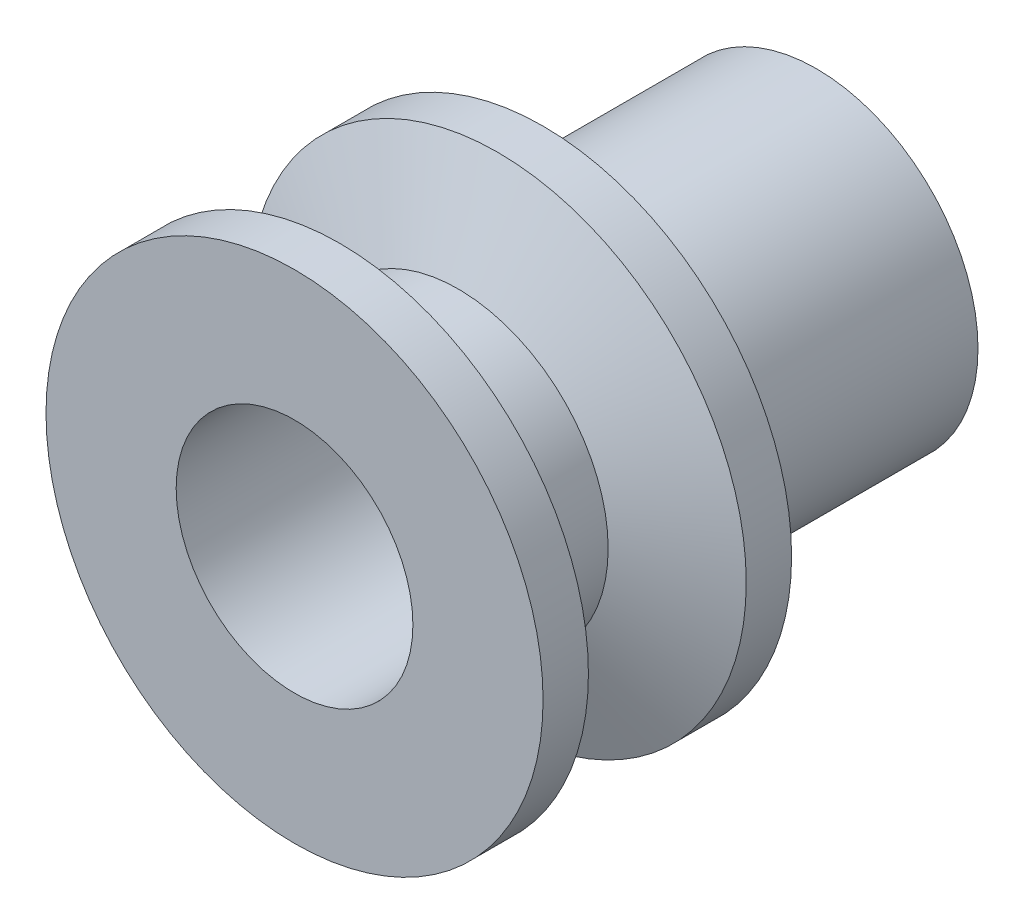
ISO-10303-21;
HEADER;
FILE_DESCRIPTION(('STEP AP214'),'2;1');
FILE_NAME('part.step','',(''),(''),'','','');
FILE_SCHEMA(('AUTOMOTIVE_DESIGN { 1 0 10303 214 1 1 1 1 }'));
ENDSEC;
DATA;
#1=APPLICATION_CONTEXT('core data for automotive mechanical design processes');
#2=APPLICATION_PROTOCOL_DEFINITION('international standard','automotive_design',2000,#1);
#3=PRODUCT_CONTEXT('',#1,'mechanical');
#4=PRODUCT('Part','Part','',(#3));
#5=PRODUCT_RELATED_PRODUCT_CATEGORY('part','',(#4));
#6=PRODUCT_DEFINITION_FORMATION('','',#4);
#7=PRODUCT_DEFINITION_CONTEXT('part definition',#1,'design');
#8=PRODUCT_DEFINITION('design','',#6,#7);
#9=PRODUCT_DEFINITION_SHAPE('','',#8);
#10=(LENGTH_UNIT() NAMED_UNIT(*) SI_UNIT(.MILLI.,.METRE.));
#11=(NAMED_UNIT(*) PLANE_ANGLE_UNIT() SI_UNIT($,.RADIAN.));
#12=(NAMED_UNIT(*) SI_UNIT($,.STERADIAN.) SOLID_ANGLE_UNIT());
#13=UNCERTAINTY_MEASURE_WITH_UNIT(LENGTH_MEASURE(1.E-05),#10,'distance_accuracy_value','');
#14=(GEOMETRIC_REPRESENTATION_CONTEXT(3) GLOBAL_UNCERTAINTY_ASSIGNED_CONTEXT((#13)) GLOBAL_UNIT_ASSIGNED_CONTEXT((#10,
#11,#12)) REPRESENTATION_CONTEXT('',''));
#15=CARTESIAN_POINT('',(0.,0.,0.));
#16=DIRECTION('',(0.,0.,1.));
#17=DIRECTION('',(1.,0.,0.));
#18=AXIS2_PLACEMENT_3D('',#15,#16,#17);
#19=CARTESIAN_POINT('',(9.52500000000001,0.,0.));
#20=DIRECTION('',(0.,0.,1.));
#21=DIRECTION('',(1.,0.,0.));
#22=AXIS2_PLACEMENT_3D('',#19,#20,#21);
#23=PLANE('',#22);
#24=CARTESIAN_POINT('',(0.,0.,0.));
#25=DIRECTION('',(0.,0.,1.));
#26=DIRECTION('',(1.,0.,0.));
#27=AXIS2_PLACEMENT_3D('',#24,#25,#26);
#28=CIRCLE('',#27,20.);
#29=CARTESIAN_POINT('',(20.,0.,0.));
#30=VERTEX_POINT('',#29);
#31=EDGE_CURVE('E10',#30,#30,#28,.T.);
#32=ORIENTED_EDGE('',*,*,#31,.T.);
#33=EDGE_LOOP('',(#32));
#34=FACE_BOUND('',#33,.T.);
#35=CARTESIAN_POINT('',(0.,0.,0.));
#36=DIRECTION('',(0.,0.,1.));
#37=DIRECTION('',(1.,0.,0.));
#38=AXIS2_PLACEMENT_3D('',#35,#36,#37);
#39=CIRCLE('',#38,9.52500000000001);
#40=CARTESIAN_POINT('',(9.52500000000001,0.,0.));
#41=VERTEX_POINT('',#40);
#42=EDGE_CURVE('E85',#41,#41,#39,.T.);
#43=ORIENTED_EDGE('',*,*,#42,.F.);
#44=EDGE_LOOP('',(#43));
#45=FACE_BOUND('',#44,.T.);
#46=ADVANCED_FACE('F37',(#34,#45),#23,.T.);
#47=CARTESIAN_POINT('',(0.,0.,0.));
#48=DIRECTION('',(0.,0.,1.));
#49=DIRECTION('',(1.,0.,0.));
#50=AXIS2_PLACEMENT_3D('',#47,#48,#49);
#51=CYLINDRICAL_SURFACE('',#50,20.);
#52=CARTESIAN_POINT('',(0.,0.,-3.65));
#53=DIRECTION('',(0.,0.,1.));
#54=DIRECTION('',(1.,0.,0.));
#55=AXIS2_PLACEMENT_3D('',#52,#53,#54);
#56=CIRCLE('',#55,20.);
#57=CARTESIAN_POINT('',(20.,0.,-3.65));
#58=VERTEX_POINT('',#57);
#59=EDGE_CURVE('E50',#58,#58,#56,.T.);
#60=ORIENTED_EDGE('',*,*,#59,.T.);
#61=EDGE_LOOP('',(#60));
#62=FACE_BOUND('',#61,.T.);
#63=ORIENTED_EDGE('',*,*,#31,.F.);
#64=EDGE_LOOP('',(#63));
#65=FACE_BOUND('',#64,.T.);
#66=ADVANCED_FACE('F119',(#62,#65),#51,.T.);
#67=CARTESIAN_POINT('',(0.,0.,-3.65));
#68=DIRECTION('',(0.,0.,1.));
#69=DIRECTION('',(1.,0.,0.));
#70=AXIS2_PLACEMENT_3D('',#67,#68,#69);
#71=CONICAL_SURFACE('',#70,20.,1.19028994968253);
#72=CARTESIAN_POINT('',(0.,0.,-6.825));
#73=DIRECTION('',(0.,0.,1.));
#74=DIRECTION('',(1.,0.,0.));
#75=AXIS2_PLACEMENT_3D('',#72,#73,#74);
#76=CIRCLE('',#75,12.0625);
#77=CARTESIAN_POINT('',(12.0625,0.,-6.825));
#78=VERTEX_POINT('',#77);
#79=EDGE_CURVE('E55',#78,#78,#76,.T.);
#80=ORIENTED_EDGE('',*,*,#79,.T.);
#81=EDGE_LOOP('',(#80));
#82=FACE_BOUND('',#81,.T.);
#83=ORIENTED_EDGE('',*,*,#59,.F.);
#84=EDGE_LOOP('',(#83));
#85=FACE_BOUND('',#84,.T.);
#86=ADVANCED_FACE('F123',(#82,#85),#71,.T.);
#87=CARTESIAN_POINT('',(0.,0.,0.));
#88=DIRECTION('',(0.,0.,1.));
#89=DIRECTION('',(1.,0.,0.));
#90=AXIS2_PLACEMENT_3D('',#87,#88,#89);
#91=CYLINDRICAL_SURFACE('',#90,12.0625);
#92=CARTESIAN_POINT('',(0.,0.,-13.175));
#93=DIRECTION('',(0.,0.,1.));
#94=DIRECTION('',(1.,0.,0.));
#95=AXIS2_PLACEMENT_3D('',#92,#93,#94);
#96=CIRCLE('',#95,12.0625);
#97=CARTESIAN_POINT('',(12.0625,0.,-13.175));
#98=VERTEX_POINT('',#97);
#99=EDGE_CURVE('E61',#98,#98,#96,.T.);
#100=ORIENTED_EDGE('',*,*,#99,.T.);
#101=EDGE_LOOP('',(#100));
#102=FACE_BOUND('',#101,.T.);
#103=ORIENTED_EDGE('',*,*,#79,.F.);
#104=EDGE_LOOP('',(#103));
#105=FACE_BOUND('',#104,.T.);
#106=ADVANCED_FACE('F133',(#102,#105),#91,.T.);
#107=CARTESIAN_POINT('',(0.,0.,-13.175));
#108=DIRECTION('',(0.,0.,-1.));
#109=DIRECTION('',(-1.,0.,0.));
#110=AXIS2_PLACEMENT_3D('',#107,#108,#109);
#111=CONICAL_SURFACE('',#110,12.0625,1.19028994968253);
#112=CARTESIAN_POINT('',(0.,0.,-16.35));
#113=DIRECTION('',(0.,0.,1.));
#114=DIRECTION('',(1.,0.,0.));
#115=AXIS2_PLACEMENT_3D('',#112,#113,#114);
#116=CIRCLE('',#115,20.);
#117=CARTESIAN_POINT('',(20.,0.,-16.35));
#118=VERTEX_POINT('',#117);
#119=EDGE_CURVE('E65',#118,#118,#116,.T.);
#120=ORIENTED_EDGE('',*,*,#119,.T.);
#121=EDGE_LOOP('',(#120));
#122=FACE_BOUND('',#121,.T.);
#123=ORIENTED_EDGE('',*,*,#99,.F.);
#124=EDGE_LOOP('',(#123));
#125=FACE_BOUND('',#124,.T.);
#126=ADVANCED_FACE('F140',(#122,#125),#111,.T.);
#127=CARTESIAN_POINT('',(0.,0.,0.));
#128=DIRECTION('',(0.,0.,1.));
#129=DIRECTION('',(1.,0.,0.));
#130=AXIS2_PLACEMENT_3D('',#127,#128,#129);
#131=CYLINDRICAL_SURFACE('',#130,20.);
#132=CARTESIAN_POINT('',(0.,0.,-20.));
#133=DIRECTION('',(0.,0.,1.));
#134=DIRECTION('',(1.,0.,0.));
#135=AXIS2_PLACEMENT_3D('',#132,#133,#134);
#136=CIRCLE('',#135,20.);
#137=CARTESIAN_POINT('',(20.,0.,-20.));
#138=VERTEX_POINT('',#137);
#139=EDGE_CURVE('E69',#138,#138,#136,.T.);
#140=ORIENTED_EDGE('',*,*,#139,.T.);
#141=EDGE_LOOP('',(#140));
#142=FACE_BOUND('',#141,.T.);
#143=ORIENTED_EDGE('',*,*,#119,.F.);
#144=EDGE_LOOP('',(#143));
#145=FACE_BOUND('',#144,.T.);
#146=ADVANCED_FACE('F144',(#142,#145),#131,.T.);
#147=CARTESIAN_POINT('',(20.,0.,-20.));
#148=DIRECTION('',(0.,0.,-1.));
#149=DIRECTION('',(-1.,0.,0.));
#150=AXIS2_PLACEMENT_3D('',#147,#148,#149);
#151=PLANE('',#150);
#152=CARTESIAN_POINT('',(0.,0.,-20.));
#153=DIRECTION('',(0.,0.,1.));
#154=DIRECTION('',(1.,0.,0.));
#155=AXIS2_PLACEMENT_3D('',#152,#153,#154);
#156=CIRCLE('',#155,13.);
#157=CARTESIAN_POINT('',(13.,0.,-20.));
#158=VERTEX_POINT('',#157);
#159=EDGE_CURVE('E73',#158,#158,#156,.T.);
#160=ORIENTED_EDGE('',*,*,#159,.T.);
#161=EDGE_LOOP('',(#160));
#162=FACE_BOUND('',#161,.T.);
#163=ORIENTED_EDGE('',*,*,#139,.F.);
#164=EDGE_LOOP('',(#163));
#165=FACE_BOUND('',#164,.T.);
#166=ADVANCED_FACE('F115',(#162,#165),#151,.T.);
#167=CARTESIAN_POINT('',(0.,0.,0.));
#168=DIRECTION('',(0.,0.,1.));
#169=DIRECTION('',(1.,0.,0.));
#170=AXIS2_PLACEMENT_3D('',#167,#168,#169);
#171=CYLINDRICAL_SURFACE('',#170,13.);
#172=CARTESIAN_POINT('',(0.,-13.,-28.825));
#173=CARTESIAN_POINT('',(-0.175551365816361,-12.9999969516406,-28.8250051559855));
#174=CARTESIAN_POINT('',(-0.351161175884213,-12.9964084766774,-28.8396088407444));
#175=CARTESIAN_POINT('',(-0.697356460310619,-12.9824408211382,-28.8975554752864));
#176=CARTESIAN_POINT('',(-0.867938880334787,-12.9720575978818,-28.9409155344945));
#177=CARTESIAN_POINT('',(-1.19902928509676,-12.9456514560528,-29.0549073655614));
#178=CARTESIAN_POINT('',(-1.35954881232047,-12.9296351436433,-29.1255072015446));
#179=CARTESIAN_POINT('',(-1.66646478190113,-12.8936729660953,-29.2918642304659));
#180=CARTESIAN_POINT('',(-1.81286090662,-12.8737270126089,-29.3876219890304));
#181=CARTESIAN_POINT('',(-2.09026270548166,-12.8316349381587,-29.6035722131689));
#182=CARTESIAN_POINT('',(-2.22095011174076,-12.8094561236453,-29.7241671654026));
#183=CARTESIAN_POINT('',(-2.46045978848675,-12.7656177054228,-29.9855063496962));
#184=CARTESIAN_POINT('',(-2.56927969796117,-12.7439581580006,-30.1262527546825));
#185=CARTESIAN_POINT('',(-2.76344416356941,-12.7032825390472,-30.4263479003176));
#186=CARTESIAN_POINT('',(-2.84843603573919,-12.6843080524224,-30.5859309780136));
#187=CARTESIAN_POINT('',(-2.99026490814376,-12.6516263358929,-30.9176573388334));
#188=CARTESIAN_POINT('',(-3.04710618481454,-12.6379183060168,-31.0897987096302));
#189=CARTESIAN_POINT('',(-3.12994113357678,-12.6176570469632,-31.4382643049251));
#190=CARTESIAN_POINT('',(-3.1565054137978,-12.6109716635613,-31.6144450283706));
#191=CARTESIAN_POINT('',(-3.17980908865312,-12.6051168222136,-31.9688794034668));
#192=CARTESIAN_POINT('',(-3.1765531009501,-12.6059462006082,-32.147132729906));
#193=CARTESIAN_POINT('',(-3.14076468536517,-12.6149082087423,-32.4963051143407));
#194=CARTESIAN_POINT('',(-3.10890881384372,-12.6228720567647,-32.6672985206509));
#195=CARTESIAN_POINT('',(-3.01790272285312,-12.6449371172117,-33.0014376462339));
#196=CARTESIAN_POINT('',(-2.95875063819478,-12.6590387490361,-33.1645828283851));
#197=CARTESIAN_POINT('',(-2.81424613920938,-12.6919475859202,-33.4802255010477));
#198=CARTESIAN_POINT('',(-2.72864537993319,-12.7107990670638,-33.6326044868618));
#199=CARTESIAN_POINT('',(-2.53384727552927,-12.7510581129028,-33.9210796655014));
#200=CARTESIAN_POINT('',(-2.42464597549614,-12.7724661057411,-34.0571731233025));
#201=CARTESIAN_POINT('',(-2.18222718442463,-12.8161393417726,-34.3130947968371));
#202=CARTESIAN_POINT('',(-2.04843788245188,-12.8384120745046,-34.4323807456316));
#203=CARTESIAN_POINT('',(-1.76248960683458,-12.8807798194032,-34.6469235050917));
#204=CARTESIAN_POINT('',(-1.61033012147515,-12.9008747708765,-34.7421796461611));
#205=CARTESIAN_POINT('',(-1.29120879629179,-12.9367155183489,-34.9061450770244));
#206=CARTESIAN_POINT('',(-1.12420173813714,-12.9524473825504,-34.9747696015362));
#207=CARTESIAN_POINT('',(-0.780553137152321,-12.9776877672235,-35.082821410586));
#208=CARTESIAN_POINT('',(-0.603913357148588,-12.9871974222713,-35.1222540182375));
#209=CARTESIAN_POINT('',(-0.250652640607375,-12.9987552450279,-35.1699821739068));
#210=CARTESIAN_POINT('',(-0.0741371795594466,-13.0009804373823,-35.1790166030983));
#211=CARTESIAN_POINT('',(0.277882766053965,-12.9982212376133,-35.1677138730494));
#212=CARTESIAN_POINT('',(0.453387335917054,-12.9932374629919,-35.1473792294903));
#213=CARTESIAN_POINT('',(0.795859128986356,-12.9767334339231,-35.0785254536602));
#214=CARTESIAN_POINT('',(0.962911666863939,-12.9653060193308,-35.0304064072617));
#215=CARTESIAN_POINT('',(1.28656704887121,-12.9372005295913,-34.9078042246619));
#216=CARTESIAN_POINT('',(1.44316886453574,-12.9205219385918,-34.8333184982255));
#217=CARTESIAN_POINT('',(1.74443978824922,-12.8833374341529,-34.6586447076416));
#218=CARTESIAN_POINT('',(1.88885901846432,-12.8627709435925,-34.5580388648768));
#219=CARTESIAN_POINT('',(2.15902809749493,-12.820192474065,-34.3345177162587));
#220=CARTESIAN_POINT('',(2.28477487318515,-12.7981802580174,-34.2115987454776));
#221=CARTESIAN_POINT('',(2.51705098057423,-12.7545588763969,-33.9435167642818));
#222=CARTESIAN_POINT('',(2.62306315827516,-12.7329711160061,-33.7979014614127));
#223=CARTESIAN_POINT('',(2.80914257957694,-12.6932189414608,-33.4905086137117));
#224=CARTESIAN_POINT('',(2.88921098319339,-12.6750543742613,-33.328731791928));
#225=CARTESIAN_POINT('',(3.02054046760657,-12.6444013383964,-32.9944855981));
#226=CARTESIAN_POINT('',(3.07197204554176,-12.631879362071,-32.8220864484254));
#227=CARTESIAN_POINT('',(3.14502921703289,-12.6138904873514,-32.4707380976986));
#228=CARTESIAN_POINT('',(3.16666097677676,-12.6084221294353,-32.2917902595724));
#229=CARTESIAN_POINT('',(3.17919347009072,-12.6052672431526,-31.9376767747725));
#230=CARTESIAN_POINT('',(3.17091936343212,-12.6073717576445,-31.7625417145451));
#231=CARTESIAN_POINT('',(3.12575501685647,-12.6186444132057,-31.4162447025826));
#232=CARTESIAN_POINT('',(3.08886530208815,-12.6278124246469,-31.2450826779944));
#233=CARTESIAN_POINT('',(2.98795794540882,-12.6520653362108,-30.9124407231039));
#234=CARTESIAN_POINT('',(2.92408837931669,-12.6671179064853,-30.7509133556985));
#235=CARTESIAN_POINT('',(2.77115272936559,-12.7014498247988,-30.4407546274957));
#236=CARTESIAN_POINT('',(2.6820833110077,-12.7207297321322,-30.2921249767551));
#237=CARTESIAN_POINT('',(2.47866048097372,-12.7619453349043,-30.0079774534427));
#238=CARTESIAN_POINT('',(2.36373143800766,-12.7839353100996,-29.8728794800834));
#239=CARTESIAN_POINT('',(2.11298240604334,-12.8277618836441,-29.6236181983029));
#240=CARTESIAN_POINT('',(1.97715749604151,-12.849598444594,-29.5094598351062));
#241=CARTESIAN_POINT('',(1.68567478938643,-12.8911021085977,-29.3034245166359));
#242=CARTESIAN_POINT('',(1.52971807887507,-12.9107258269389,-29.211961072223));
#243=CARTESIAN_POINT('',(1.20418071858633,-12.9451399972524,-29.0566955052907));
#244=CARTESIAN_POINT('',(1.03461027236067,-12.9599340277293,-28.9928728910945));
#245=CARTESIAN_POINT('',(0.721036019859213,-12.9807455446848,-28.9045491934073));
#246=CARTESIAN_POINT('',(0.578569069705992,-12.9879173408346,-28.8747811989544));
#247=CARTESIAN_POINT('',(0.290747977405409,-12.9975456697109,-28.8350051423499));
#248=CARTESIAN_POINT('',(0.14539403326366,-13.0000025246928,-28.8249957297426));
#249=CARTESIAN_POINT('',(0.,-13.,-28.825));
#250=B_SPLINE_CURVE_WITH_KNOTS('',3,(#172,#173,#174,#175,#176,#177,#178,#179,#180,#181,#182,
#183,#184,#185,#186,#187,#188,#189,#190,#191,#192,#193,#194,#195,#196,#197,#198,#199,#200,#201,
#202,#203,#204,#205,#206,#207,#208,#209,#210,#211,#212,#213,#214,#215,#216,#217,#218,#219,#220,
#221,#222,#223,#224,#225,#226,#227,#228,#229,#230,#231,#232,#233,#234,#235,#236,#237,#238,#239,
#240,#241,#242,#243,#244,#245,#246,#247,#248,#249),.UNSPECIFIED.,.T.,.F.,(4,2,2,2,2,2,2,2,2,2,2,
2,2,2,2,2,2,2,2,2,2,2,2,2,2,2,2,2,2,2,2,2,2,2,2,2,2,2,4),(0.,0.526121404642195,1.05255612138418,
1.57837551307464,2.1042067277908,2.6393449624573,3.17454094447412,3.71728413738374,
4.25994485534128,4.79219996415766,5.32437265476789,5.84427868347949,6.36422024337384,
6.88920040855781,7.41426861659789,7.95360015181282,8.49294671396923,9.03399614198746,
9.57494688593026,10.1026500297655,10.630307974549,11.1505508628142,11.6708448733886,
12.2000370128938,12.7293161509,13.2709511448865,13.8125619175793,14.3509126064642,
14.8891518829114,15.4126548814284,15.9361482729354,16.4568051143902,16.9775308825315,
17.5112547956804,18.045104594451,18.5880652353494,19.1306226575562,19.5663933589043,
20.0021342752541),.UNSPECIFIED.);
#251=CARTESIAN_POINT('',(0.,-13.,-28.825));
#252=VERTEX_POINT('',#251);
#253=EDGE_CURVE('E89',#252,#252,#250,.T.);
#254=ORIENTED_EDGE('',*,*,#253,.F.);
#255=EDGE_LOOP('',(#254));
#256=FACE_BOUND('',#255,.T.);
#257=CARTESIAN_POINT('',(0.,0.,-42.));
#258=DIRECTION('',(0.,0.,1.));
#259=DIRECTION('',(1.,0.,0.));
#260=AXIS2_PLACEMENT_3D('',#257,#258,#259);
#261=CIRCLE('',#260,13.);
#262=CARTESIAN_POINT('',(13.,0.,-42.));
#263=VERTEX_POINT('',#262);
#264=EDGE_CURVE('E77',#263,#263,#261,.T.);
#265=ORIENTED_EDGE('',*,*,#264,.T.);
#266=EDGE_LOOP('',(#265));
#267=FACE_BOUND('',#266,.T.);
#268=ORIENTED_EDGE('',*,*,#159,.F.);
#269=EDGE_LOOP('',(#268));
#270=FACE_BOUND('',#269,.T.);
#271=ADVANCED_FACE('F96',(#256,#267,#270),#171,.T.);
#272=CARTESIAN_POINT('',(13.,0.,-42.));
#273=DIRECTION('',(0.,0.,-1.));
#274=DIRECTION('',(-1.,0.,0.));
#275=AXIS2_PLACEMENT_3D('',#272,#273,#274);
#276=PLANE('',#275);
#277=CARTESIAN_POINT('',(0.,0.,-42.));
#278=DIRECTION('',(0.,0.,1.));
#279=DIRECTION('',(1.,0.,0.));
#280=AXIS2_PLACEMENT_3D('',#277,#278,#279);
#281=CIRCLE('',#280,9.525);
#282=CARTESIAN_POINT('',(9.525,0.,-42.));
#283=VERTEX_POINT('',#282);
#284=EDGE_CURVE('E81',#283,#283,#281,.T.);
#285=ORIENTED_EDGE('',*,*,#284,.T.);
#286=EDGE_LOOP('',(#285));
#287=FACE_BOUND('',#286,.T.);
#288=ORIENTED_EDGE('',*,*,#264,.F.);
#289=EDGE_LOOP('',(#288));
#290=FACE_BOUND('',#289,.T.);
#291=ADVANCED_FACE('F108',(#287,#290),#276,.T.);
#292=CARTESIAN_POINT('',(0.,0.,0.));
#293=DIRECTION('',(0.,0.,1.));
#294=DIRECTION('',(1.,0.,0.));
#295=AXIS2_PLACEMENT_3D('',#292,#293,#294);
#296=CYLINDRICAL_SURFACE('',#295,9.525);
#297=CARTESIAN_POINT('',(0.,-9.525,-28.825));
#298=CARTESIAN_POINT('',(0.173238677165346,-9.52500048580498,-28.824999194402));
#299=CARTESIAN_POINT('',(0.346472492659896,-9.52023018186455,-28.8392248449539));
#300=CARTESIAN_POINT('',(0.687837590771687,-9.50167042395417,-28.8955774204947));
#301=CARTESIAN_POINT('',(0.855968341777246,-9.48788003366835,-28.9377072420378));
#302=CARTESIAN_POINT('',(1.18215660666814,-9.45277852602955,-29.0482635977444));
#303=CARTESIAN_POINT('',(1.34023044718816,-9.43147998545459,-29.1166461733082));
#304=CARTESIAN_POINT('',(1.6426654243569,-9.3835361515256,-29.2775682237618));
#305=CARTESIAN_POINT('',(1.78702384834389,-9.35688980370195,-29.3701124638833));
#306=CARTESIAN_POINT('',(2.06292981819569,-9.30002249856541,-29.5800969304265));
#307=CARTESIAN_POINT('',(2.19393674844713,-9.26971591772517,-29.6982241687771));
#308=CARTESIAN_POINT('',(2.43469379932912,-9.20941499436411,-29.9545607161933));
#309=CARTESIAN_POINT('',(2.54443923892904,-9.17942072197494,-30.092774435898));
#310=CARTESIAN_POINT('',(2.74264419157345,-9.12219830615344,-30.3902277407488));
#311=CARTESIAN_POINT('',(2.83040092485178,-9.0950744970031,-30.5499576236495));
#312=CARTESIAN_POINT('',(2.97757492456177,-9.04796594704059,-30.8829590999059));
#313=CARTESIAN_POINT('',(3.03700083920298,-9.02797902810368,-31.0562265419917));
#314=CARTESIAN_POINT('',(3.12379824029159,-8.99830887880273,-31.4052374782521));
#315=CARTESIAN_POINT('',(3.15218269826287,-8.98830104068516,-31.5807006369528));
#316=CARTESIAN_POINT('',(3.17925806658696,-8.97876209798686,-31.9341624194449));
#317=CARTESIAN_POINT('',(3.17795815259498,-8.97922775597168,-32.1121602427517));
#318=CARTESIAN_POINT('',(3.14648819425835,-8.99029872650972,-32.4569988016598));
#319=CARTESIAN_POINT('',(3.11764017430521,-9.00043970379418,-32.6239776792679));
#320=CARTESIAN_POINT('',(3.0340495670469,-9.02895888275449,-32.9505741072517));
#321=CARTESIAN_POINT('',(2.97930387942919,-9.04733807064542,-33.1101907737564));
#322=CARTESIAN_POINT('',(2.84460650934117,-9.09059367841715,-33.420535479953));
#323=CARTESIAN_POINT('',(2.76426310464556,-9.11556996393148,-33.5710789808657));
#324=CARTESIAN_POINT('',(2.58092291251246,-9.16916373477931,-33.8569651337881));
#325=CARTESIAN_POINT('',(2.47791958175572,-9.19778227084722,-33.9923033780135));
#326=CARTESIAN_POINT('',(2.2458341312661,-9.25726270107577,-34.2513658241605));
#327=CARTESIAN_POINT('',(2.11567125149229,-9.28816371201626,-34.3741148050663));
#328=CARTESIAN_POINT('',(1.83622813465495,-9.34742029378842,-34.5962967716563));
#329=CARTESIAN_POINT('',(1.68694606622308,-9.37577562033364,-34.6957275211723));
#330=CARTESIAN_POINT('',(1.3714336714219,-9.42711817702495,-34.8692357532463));
#331=CARTESIAN_POINT('',(1.20504990262187,-9.45004936275525,-34.9430519350068));
#332=CARTESIAN_POINT('',(0.861279339682312,-9.48755300683581,-35.0613450773094));
#333=CARTESIAN_POINT('',(0.683896391141979,-9.50212836854242,-35.1058322294694));
#334=CARTESIAN_POINT('',(0.331418658755541,-9.52079715951824,-35.162476739621));
#335=CARTESIAN_POINT('',(0.156557979570888,-9.52531755822087,-35.1759518941235));
#336=CARTESIAN_POINT('',(-0.192960847123753,-9.52464766056077,-35.1739437613249));
#337=CARTESIAN_POINT('',(-0.36761902383989,-9.51945900331476,-35.1584653620639));
#338=CARTESIAN_POINT('',(-0.706500575516011,-9.50023578476806,-35.1000321929383));
#339=CARTESIAN_POINT('',(-0.870879661700627,-9.48646180908036,-35.0578862957929));
#340=CARTESIAN_POINT('',(-1.19016766849014,-9.45171613685472,-34.9483258138181));
#341=CARTESIAN_POINT('',(-1.34507537851482,-9.43074352248194,-34.8809080066898));
#342=CARTESIAN_POINT('',(-1.64556534104864,-9.38304356837145,-34.7207513789055));
#343=CARTESIAN_POINT('',(-1.79079512051444,-9.35617936849621,-34.6273931663259));
#344=CARTESIAN_POINT('',(-2.06395583568049,-9.29974181184133,-34.4187335737072));
#345=CARTESIAN_POINT('',(-2.19188146775095,-9.27016762910403,-34.3034254920991));
#346=CARTESIAN_POINT('',(-2.432851712285,-9.20993992337912,-34.0479424655541));
#347=CARTESIAN_POINT('',(-2.54495607735532,-9.17929841452584,-33.9068757045072));
#348=CARTESIAN_POINT('',(-2.74401763337735,-9.121774152107,-33.6072752722004));
#349=CARTESIAN_POINT('',(-2.83097461468097,-9.09489142987858,-33.4487414553368));
#350=CARTESIAN_POINT('',(-2.97687025407195,-9.04819093937643,-33.1186381764546));
#351=CARTESIAN_POINT('',(-3.03586556962394,-9.02835890517708,-32.9470958986392));
#352=CARTESIAN_POINT('',(-3.12386556696095,-8.99829392572978,-32.5956977861099));
#353=CARTESIAN_POINT('',(-3.15288375947876,-8.98805665630055,-32.4158457348412));
#354=CARTESIAN_POINT('',(-3.17905219686556,-8.97883201925513,-32.0628742200701));
#355=CARTESIAN_POINT('',(-3.17776306695417,-8.97929370817293,-31.8898835695893));
#356=CARTESIAN_POINT('',(-3.1471942816996,-8.99005281690779,-31.5467208871225));
#357=CARTESIAN_POINT('',(-3.11791629228101,-9.00034965132723,-31.3765486879926));
#358=CARTESIAN_POINT('',(-3.03330550668567,-9.02920864668031,-31.0470692699672));
#359=CARTESIAN_POINT('',(-2.97847812359926,-9.04761011221366,-30.8876170806107));
#360=CARTESIAN_POINT('',(-2.8447344862872,-9.09054566248638,-30.580052982971));
#361=CARTESIAN_POINT('',(-2.76581288515833,-9.11508110823773,-30.4319436009781));
#362=CARTESIAN_POINT('',(-2.58210269895239,-9.16885482792697,-30.1442643479948));
#363=CARTESIAN_POINT('',(-2.47633567077754,-9.19825159463785,-30.0053491064726));
#364=CARTESIAN_POINT('',(-2.24359115395568,-9.25777156199328,-29.7467348425052));
#365=CARTESIAN_POINT('',(-2.11660766813345,-9.28789496596782,-29.6270412721904));
#366=CARTESIAN_POINT('',(-1.83909194322319,-9.34688346918603,-29.4055664909819));
#367=CARTESIAN_POINT('',(-1.68783480536164,-9.3756537721899,-29.3046651958906));
#368=CARTESIAN_POINT('',(-1.36955960976603,-9.42740021973043,-29.1298303883992));
#369=CARTESIAN_POINT('',(-1.20254559507021,-9.45037784507677,-29.0558899816975));
#370=CARTESIAN_POINT('',(-0.865167329863101,-9.48707510342621,-28.9401838168485));
#371=CARTESIAN_POINT('',(-0.6952861306226,-9.5011624944151,-28.8971281696138));
#372=CARTESIAN_POINT('',(-0.350267320832536,-9.52012342428904,-28.8395406088501));
#373=CARTESIAN_POINT('',(-0.175131176180771,-9.52499950888798,-28.8250008143985));
#374=CARTESIAN_POINT('',(0.,-9.525,-28.825));
#375=B_SPLINE_CURVE_WITH_KNOTS('',3,(#297,#298,#299,#300,#301,#302,#303,#304,#305,#306,#307,
#308,#309,#310,#311,#312,#313,#314,#315,#316,#317,#318,#319,#320,#321,#322,#323,#324,#325,#326,
#327,#328,#329,#330,#331,#332,#333,#334,#335,#336,#337,#338,#339,#340,#341,#342,#343,#344,#345,
#346,#347,#348,#349,#350,#351,#352,#353,#354,#355,#356,#357,#358,#359,#360,#361,#362,#363,#364,
#365,#366,#367,#368,#369,#370,#371,#372,#373,#374),.UNSPECIFIED.,.T.,.F.,(4,2,2,2,2,2,2,2,2,2,2,
2,2,2,2,2,2,2,2,2,2,2,2,2,2,2,2,2,2,2,2,2,2,2,2,2,2,2,4),(0.,0.519071561632585,1.03819701322438,
1.55645698636312,2.07481924951214,2.6093637259775,3.14402575687908,3.69406121814519,
4.24392866899746,4.77526114230341,5.30642937910266,5.81332424300316,6.32027980466156,
6.8353994341754,7.35066800622307,7.8928374595109,8.43505888444013,8.98265937939885,
9.53006948685136,10.0537512658116,10.5773446429626,11.0857715158083,11.5942632377703,
12.1161301950386,12.638156741095,13.1839024764639,13.7296527614611,14.274292439,
14.8186865394104,15.3351123975402,15.8515075194062,16.3580948898032,16.8647947620873,
17.3936046174648,17.92256420318,18.4721392315144,19.0215736265905,19.5464607283686,
20.0712027467109),.UNSPECIFIED.);
#376=CARTESIAN_POINT('',(0.,-9.525,-28.825));
#377=VERTEX_POINT('',#376);
#378=EDGE_CURVE('E40',#377,#377,#375,.T.);
#379=ORIENTED_EDGE('',*,*,#378,.F.);
#380=EDGE_LOOP('',(#379));
#381=FACE_BOUND('',#380,.T.);
#382=ORIENTED_EDGE('',*,*,#42,.T.);
#383=EDGE_LOOP('',(#382));
#384=FACE_BOUND('',#383,.T.);
#385=ORIENTED_EDGE('',*,*,#284,.F.);
#386=EDGE_LOOP('',(#385));
#387=FACE_BOUND('',#386,.T.);
#388=ADVANCED_FACE('F103',(#381,#384,#387),#296,.F.);
#389=CARTESIAN_POINT('',(0.,-20.,-32.));
#390=DIRECTION('',(0.,1.,0.));
#391=DIRECTION('',(0.,0.,1.));
#392=AXIS2_PLACEMENT_3D('',#389,#390,#391);
#393=CYLINDRICAL_SURFACE('',#392,3.175);
#394=ORIENTED_EDGE('',*,*,#253,.T.);
#395=EDGE_LOOP('',(#394));
#396=FACE_BOUND('',#395,.T.);
#397=ORIENTED_EDGE('',*,*,#378,.T.);
#398=EDGE_LOOP('',(#397));
#399=FACE_BOUND('',#398,.T.);
#400=ADVANCED_FACE('F100',(#396,#399),#393,.F.);
#401=CLOSED_SHELL('',(#46,#66,#86,#106,#126,#146,#166,#271,#291,#388,#400));
#402=MANIFOLD_SOLID_BREP('B2',#401);
#403=ADVANCED_BREP_SHAPE_REPRESENTATION('',(#18,#402),#14);
#404=SHAPE_DEFINITION_REPRESENTATION(#9,#403);
ENDSEC;
END-ISO-10303-21;
